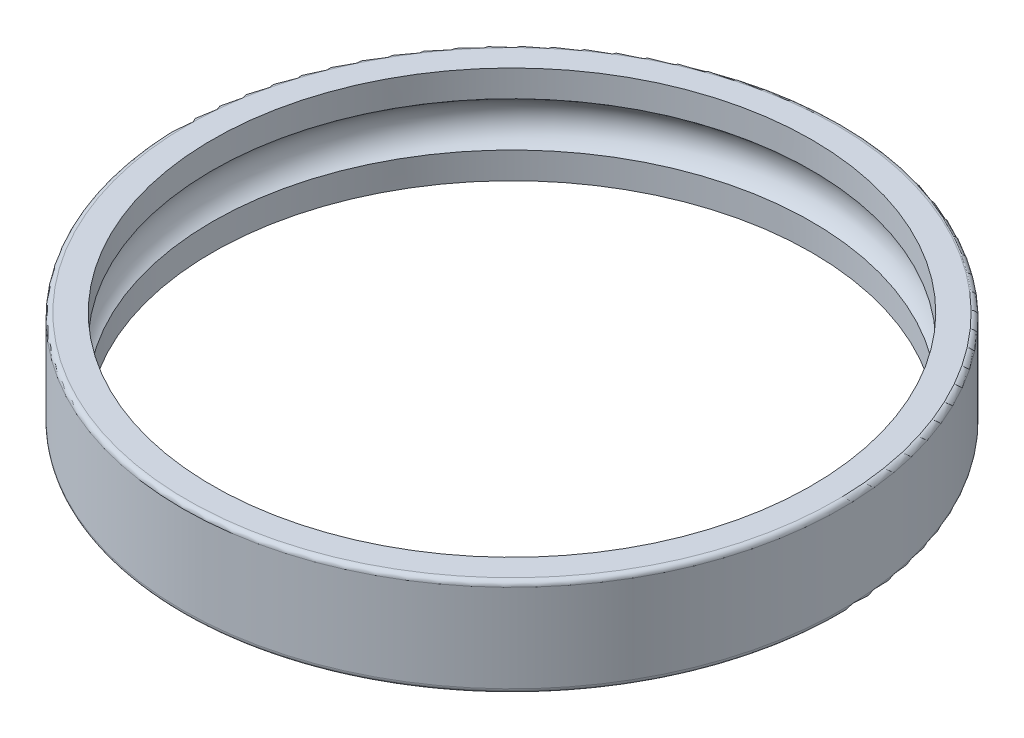
ISO-10303-21;
HEADER;
FILE_DESCRIPTION(('STEP AP214'),'2;1');
FILE_NAME('part.step','',(''),(''),'','','');
FILE_SCHEMA(('AUTOMOTIVE_DESIGN { 1 0 10303 214 1 1 1 1 }'));
ENDSEC;
DATA;
#1=APPLICATION_CONTEXT('core data for automotive mechanical design processes');
#2=APPLICATION_PROTOCOL_DEFINITION('international standard','automotive_design',2000,#1);
#3=PRODUCT_CONTEXT('',#1,'mechanical');
#4=PRODUCT('Part','Part','',(#3));
#5=PRODUCT_RELATED_PRODUCT_CATEGORY('part','',(#4));
#6=PRODUCT_DEFINITION_FORMATION('','',#4);
#7=PRODUCT_DEFINITION_CONTEXT('part definition',#1,'design');
#8=PRODUCT_DEFINITION('design','',#6,#7);
#9=PRODUCT_DEFINITION_SHAPE('','',#8);
#10=(LENGTH_UNIT() NAMED_UNIT(*) SI_UNIT(.MILLI.,.METRE.));
#11=(NAMED_UNIT(*) PLANE_ANGLE_UNIT() SI_UNIT($,.RADIAN.));
#12=(NAMED_UNIT(*) SI_UNIT($,.STERADIAN.) SOLID_ANGLE_UNIT());
#13=UNCERTAINTY_MEASURE_WITH_UNIT(LENGTH_MEASURE(1.E-05),#10,'distance_accuracy_value','');
#14=(GEOMETRIC_REPRESENTATION_CONTEXT(3) GLOBAL_UNCERTAINTY_ASSIGNED_CONTEXT((#13)) GLOBAL_UNIT_ASSIGNED_CONTEXT((#10,
#11,#12)) REPRESENTATION_CONTEXT('',''));
#15=CARTESIAN_POINT('',(0.,0.,0.));
#16=DIRECTION('',(0.,0.,1.));
#17=DIRECTION('',(1.,0.,0.));
#18=AXIS2_PLACEMENT_3D('',#15,#16,#17);
#19=CARTESIAN_POINT('',(0.,-0.54533666301317,0.));
#20=DIRECTION('',(0.,1.,0.));
#21=DIRECTION('',(0.,0.,1.));
#22=AXIS2_PLACEMENT_3D('',#19,#20,#21);
#23=CYLINDRICAL_SURFACE('',#22,12.275);
#24=CARTESIAN_POINT('',(0.,-1.09067332602634,0.));
#25=DIRECTION('',(0.,1.,0.));
#26=DIRECTION('',(0.,0.,1.));
#27=AXIS2_PLACEMENT_3D('',#24,#25,#26);
#28=CIRCLE('',#27,12.275);
#29=CARTESIAN_POINT('',(2.323059024524,-1.09067332602634,12.0531747588997));
#30=VERTEX_POINT('',#29);
#31=EDGE_CURVE('E83',#30,#30,#28,.T.);
#32=ORIENTED_EDGE('',*,*,#31,.F.);
#33=EDGE_LOOP('',(#32));
#34=FACE_BOUND('',#33,.T.);
#35=CARTESIAN_POINT('',(0.,0.,0.));
#36=DIRECTION('',(0.,1.,0.));
#37=DIRECTION('',(0.,0.,1.));
#38=AXIS2_PLACEMENT_3D('',#35,#36,#37);
#39=CIRCLE('',#38,12.275);
#40=CARTESIAN_POINT('',(0.,0.,-12.275));
#41=VERTEX_POINT('',#40);
#42=EDGE_CURVE('E11',#41,#41,#39,.T.);
#43=ORIENTED_EDGE('',*,*,#42,.T.);
#44=EDGE_LOOP('',(#43));
#45=FACE_BOUND('',#44,.T.);
#46=ADVANCED_FACE('F16',(#34,#45),#23,.F.);
#47=CARTESIAN_POINT('',(0.,0.,12.7875));
#48=DIRECTION('',(0.,1.,0.));
#49=DIRECTION('',(1.,0.,0.));
#50=AXIS2_PLACEMENT_3D('',#47,#48,#49);
#51=PLANE('',#50);
#52=CARTESIAN_POINT('',(0.,0.,0.));
#53=DIRECTION('',(0.,1.,0.));
#54=DIRECTION('',(0.,0.,1.));
#55=AXIS2_PLACEMENT_3D('',#52,#53,#54);
#56=CIRCLE('',#55,13.3);
#57=CARTESIAN_POINT('',(0.,0.,-13.3));
#58=VERTEX_POINT('',#57);
#59=EDGE_CURVE('E87',#58,#58,#56,.T.);
#60=ORIENTED_EDGE('',*,*,#59,.T.);
#61=EDGE_LOOP('',(#60));
#62=FACE_BOUND('',#61,.T.);
#63=ORIENTED_EDGE('',*,*,#42,.F.);
#64=EDGE_LOOP('',(#63));
#65=FACE_BOUND('',#64,.T.);
#66=ADVANCED_FACE('F103',(#62,#65),#51,.T.);
#67=CARTESIAN_POINT('',(0.,-3.45466333698683,0.));
#68=DIRECTION('',(0.,1.,0.));
#69=DIRECTION('',(0.,0.,1.));
#70=AXIS2_PLACEMENT_3D('',#67,#68,#69);
#71=CYLINDRICAL_SURFACE('',#70,12.275);
#72=CARTESIAN_POINT('',(0.,-4.,0.));
#73=DIRECTION('',(0.,1.,0.));
#74=DIRECTION('',(0.,0.,1.));
#75=AXIS2_PLACEMENT_3D('',#72,#73,#74);
#76=CIRCLE('',#75,12.275);
#77=CARTESIAN_POINT('',(0.,-4.,-12.275));
#78=VERTEX_POINT('',#77);
#79=EDGE_CURVE('E27',#78,#78,#76,.T.);
#80=ORIENTED_EDGE('',*,*,#79,.F.);
#81=EDGE_LOOP('',(#80));
#82=FACE_BOUND('',#81,.T.);
#83=CARTESIAN_POINT('',(0.,-2.90932667397366,0.));
#84=DIRECTION('',(0.,1.,0.));
#85=DIRECTION('',(0.,0.,1.));
#86=AXIS2_PLACEMENT_3D('',#83,#84,#85);
#87=CIRCLE('',#86,12.275);
#88=CARTESIAN_POINT('',(4.56215664323048,-2.90932667397366,11.3957163777723));
#89=VERTEX_POINT('',#88);
#90=EDGE_CURVE('E86',#89,#89,#87,.T.);
#91=ORIENTED_EDGE('',*,*,#90,.T.);
#92=EDGE_LOOP('',(#91));
#93=FACE_BOUND('',#92,.T.);
#94=ADVANCED_FACE('F100',(#82,#93),#71,.F.);
#95=CARTESIAN_POINT('',(0.,-4.,12.7875));
#96=DIRECTION('',(0.,-1.,0.));
#97=DIRECTION('',(-1.,0.,0.));
#98=AXIS2_PLACEMENT_3D('',#95,#96,#97);
#99=PLANE('',#98);
#100=ORIENTED_EDGE('',*,*,#79,.T.);
#101=EDGE_LOOP('',(#100));
#102=FACE_BOUND('',#101,.T.);
#103=CARTESIAN_POINT('',(0.,-4.,0.));
#104=DIRECTION('',(0.,1.,0.));
#105=DIRECTION('',(0.,0.,1.));
#106=AXIS2_PLACEMENT_3D('',#103,#104,#105);
#107=CIRCLE('',#106,13.3);
#108=CARTESIAN_POINT('',(0.,-4.,-13.3));
#109=VERTEX_POINT('',#108);
#110=EDGE_CURVE('E77',#109,#109,#107,.T.);
#111=ORIENTED_EDGE('',*,*,#110,.F.);
#112=EDGE_LOOP('',(#111));
#113=FACE_BOUND('',#112,.T.);
#114=ADVANCED_FACE('F97',(#102,#113),#99,.T.);
#115=CARTESIAN_POINT('',(0.,-0.2,0.));
#116=DIRECTION('',(0.,1.,0.));
#117=DIRECTION('',(0.,0.,1.));
#118=AXIS2_PLACEMENT_3D('',#115,#116,#117);
#119=TOROIDAL_SURFACE('',#118,13.3,0.2);
#120=ORIENTED_EDGE('',*,*,#59,.F.);
#121=EDGE_LOOP('',(#120));
#122=FACE_BOUND('',#121,.T.);
#123=CARTESIAN_POINT('',(0.,-0.2,0.));
#124=DIRECTION('',(0.,1.,0.));
#125=DIRECTION('',(0.,0.,1.));
#126=AXIS2_PLACEMENT_3D('',#123,#124,#125);
#127=CIRCLE('',#126,13.5);
#128=CARTESIAN_POINT('',(0.,-0.2,-13.5));
#129=VERTEX_POINT('',#128);
#130=EDGE_CURVE('E61',#129,#129,#127,.T.);
#131=ORIENTED_EDGE('',*,*,#130,.T.);
#132=EDGE_LOOP('',(#131));
#133=FACE_BOUND('',#132,.T.);
#134=ADVANCED_FACE('F111',(#122,#133),#119,.T.);
#135=CARTESIAN_POINT('',(0.,-2.,0.));
#136=DIRECTION('',(0.,1.,0.));
#137=DIRECTION('',(0.,0.,1.));
#138=AXIS2_PLACEMENT_3D('',#135,#136,#137);
#139=TOROIDAL_SURFACE('',#138,11.75,1.05);
#140=ORIENTED_EDGE('',*,*,#90,.F.);
#141=EDGE_LOOP('',(#140));
#142=FACE_BOUND('',#141,.T.);
#143=ORIENTED_EDGE('',*,*,#31,.T.);
#144=EDGE_LOOP('',(#143));
#145=FACE_BOUND('',#144,.T.);
#146=ADVANCED_FACE('F107',(#142,#145),#139,.F.);
#147=CARTESIAN_POINT('',(0.,-3.8,0.));
#148=DIRECTION('',(0.,1.,0.));
#149=DIRECTION('',(0.,0.,1.));
#150=AXIS2_PLACEMENT_3D('',#147,#148,#149);
#151=TOROIDAL_SURFACE('',#150,13.3,0.2);
#152=CARTESIAN_POINT('',(0.,-3.8,0.));
#153=DIRECTION('',(0.,1.,0.));
#154=DIRECTION('',(0.,0.,1.));
#155=AXIS2_PLACEMENT_3D('',#152,#153,#154);
#156=CIRCLE('',#155,13.5);
#157=CARTESIAN_POINT('',(0.,-3.8,-13.5));
#158=VERTEX_POINT('',#157);
#159=EDGE_CURVE('E20',#158,#158,#156,.T.);
#160=ORIENTED_EDGE('',*,*,#159,.F.);
#161=EDGE_LOOP('',(#160));
#162=FACE_BOUND('',#161,.T.);
#163=ORIENTED_EDGE('',*,*,#110,.T.);
#164=EDGE_LOOP('',(#163));
#165=FACE_BOUND('',#164,.T.);
#166=ADVANCED_FACE('F110',(#162,#165),#151,.T.);
#167=CARTESIAN_POINT('',(0.,-2.,0.));
#168=DIRECTION('',(0.,1.,0.));
#169=DIRECTION('',(0.,0.,1.));
#170=AXIS2_PLACEMENT_3D('',#167,#168,#169);
#171=CYLINDRICAL_SURFACE('',#170,13.5);
#172=ORIENTED_EDGE('',*,*,#130,.F.);
#173=EDGE_LOOP('',(#172));
#174=FACE_BOUND('',#173,.T.);
#175=ORIENTED_EDGE('',*,*,#159,.T.);
#176=EDGE_LOOP('',(#175));
#177=FACE_BOUND('',#176,.T.);
#178=ADVANCED_FACE('F18',(#174,#177),#171,.T.);
#179=CLOSED_SHELL('',(#46,#66,#94,#114,#134,#146,#166,#178));
#180=MANIFOLD_SOLID_BREP('B1',#179);
#181=ADVANCED_BREP_SHAPE_REPRESENTATION('',(#18,#180),#14);
#182=SHAPE_DEFINITION_REPRESENTATION(#9,#181);
ENDSEC;
END-ISO-10303-21;
